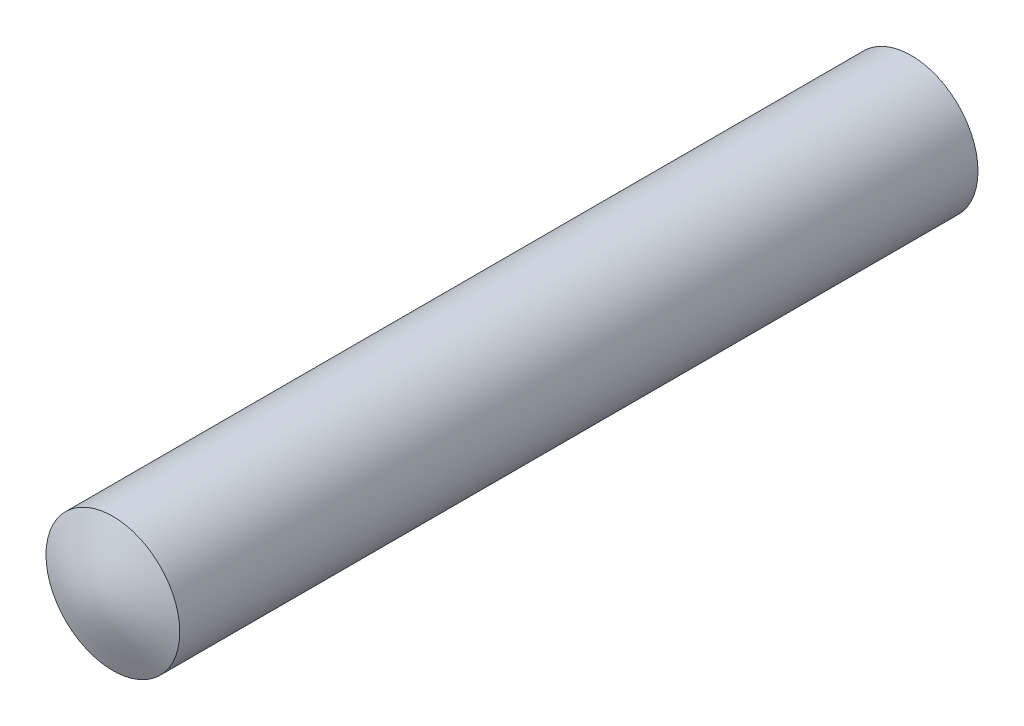
ISO-10303-21;
HEADER;
FILE_DESCRIPTION(('STEP AP214'),'2;1');
FILE_NAME('part.step','',(''),(''),'','','');
FILE_SCHEMA(('AUTOMOTIVE_DESIGN { 1 0 10303 214 1 1 1 1 }'));
ENDSEC;
DATA;
#1=APPLICATION_CONTEXT('core data for automotive mechanical design processes');
#2=APPLICATION_PROTOCOL_DEFINITION('international standard','automotive_design',2000,#1);
#3=PRODUCT_CONTEXT('',#1,'mechanical');
#4=PRODUCT('Part','Part','',(#3));
#5=PRODUCT_RELATED_PRODUCT_CATEGORY('part','',(#4));
#6=PRODUCT_DEFINITION_FORMATION('','',#4);
#7=PRODUCT_DEFINITION_CONTEXT('part definition',#1,'design');
#8=PRODUCT_DEFINITION('design','',#6,#7);
#9=PRODUCT_DEFINITION_SHAPE('','',#8);
#10=(LENGTH_UNIT() NAMED_UNIT(*) SI_UNIT(.MILLI.,.METRE.));
#11=(NAMED_UNIT(*) PLANE_ANGLE_UNIT() SI_UNIT($,.RADIAN.));
#12=(NAMED_UNIT(*) SI_UNIT($,.STERADIAN.) SOLID_ANGLE_UNIT());
#13=UNCERTAINTY_MEASURE_WITH_UNIT(LENGTH_MEASURE(1.E-05),#10,'distance_accuracy_value','');
#14=(GEOMETRIC_REPRESENTATION_CONTEXT(3) GLOBAL_UNCERTAINTY_ASSIGNED_CONTEXT((#13)) GLOBAL_UNIT_ASSIGNED_CONTEXT((#10,
#11,#12)) REPRESENTATION_CONTEXT('',''));
#15=CARTESIAN_POINT('',(0.,0.,0.));
#16=DIRECTION('',(0.,0.,1.));
#17=DIRECTION('',(1.,0.,0.));
#18=AXIS2_PLACEMENT_3D('',#15,#16,#17);
#19=CARTESIAN_POINT('',(-10.5244594907688,30.0492875827461,10.));
#20=DIRECTION('',(0.,0.,-1.));
#21=DIRECTION('',(-1.,0.,0.));
#22=AXIS2_PLACEMENT_3D('',#19,#20,#21);
#23=CYLINDRICAL_SURFACE('',#22,1.67526348251068);
#24=CARTESIAN_POINT('',(-12.1997229732795,30.0492875827195,10.0001212000588));
#25=CARTESIAN_POINT('',(-12.1997188004458,29.9551873017576,10.0001218226502));
#26=CARTESIAN_POINT('',(-12.191767888915,29.8610187900836,10.0001401553826));
#27=CARTESIAN_POINT('',(-12.1601604616911,29.6752752295067,10.0001326342529));
#28=CARTESIAN_POINT('',(-12.1364850439584,29.5837034403635,10.0001067271522));
#29=CARTESIAN_POINT('',(-12.0741025868434,29.4058711383558,10.0000947877364));
#30=CARTESIAN_POINT('',(-12.0354027259847,29.3196081117882,10.0001087363987));
#31=CARTESIAN_POINT('',(-11.944079792868,29.1548278056967,10.0001445191069));
#32=CARTESIAN_POINT('',(-11.8914601826877,29.0763086068087,10.0001663511924));
#33=CARTESIAN_POINT('',(-11.77378081401,28.9292089731597,10.0001901776857));
#34=CARTESIAN_POINT('',(-11.7087197574196,28.8606295767934,10.0001921700224));
#35=CARTESIAN_POINT('',(-11.5680050204534,28.735364465703,10.0001766108316));
#36=CARTESIAN_POINT('',(-11.492350924236,28.6786792181151,10.0001590585368));
#37=CARTESIAN_POINT('',(-11.3326012508319,28.5788156882472,10.0001188825536));
#38=CARTESIAN_POINT('',(-11.2485058319692,28.5356371526998,10.0000962589602));
#39=CARTESIAN_POINT('',(-11.0742597200714,28.4640114473262,10.0001010328882));
#40=CARTESIAN_POINT('',(-10.9841090392165,28.4355642478687,10.0001284303089));
#41=CARTESIAN_POINT('',(-10.8003112029227,28.3942085621746,10.0001515300006));
#42=CARTESIAN_POINT('',(-10.7066640416123,28.3813001020321,10.0001472322183));
#43=CARTESIAN_POINT('',(-10.5185319276214,28.3713884295552,10.0001501633563));
#44=CARTESIAN_POINT('',(-10.4240469764517,28.3743851885432,10.0001573922557));
#45=CARTESIAN_POINT('',(-10.2369211819921,28.3961988257896,10.0001471554434));
#46=CARTESIAN_POINT('',(-10.144280340202,28.4150157169134,10.0001296897116));
#47=CARTESIAN_POINT('',(-9.96347254225981,28.4679355095454,10.0001055447999));
#48=CARTESIAN_POINT('',(-9.87530559079551,28.5020384270703,10.0000988656314));
#49=CARTESIAN_POINT('',(-9.70594853027016,28.5845621700248,10.0001175652572));
#50=CARTESIAN_POINT('',(-9.62475841749602,28.6329829878343,10.0001429440345));
#51=CARTESIAN_POINT('',(-9.47165975492466,28.7427679942534,10.0001786221683));
#52=CARTESIAN_POINT('',(-9.39975120130801,28.8041321775366,10.000188921531));
#53=CARTESIAN_POINT('',(-9.26725685927908,28.9380620111202,10.0001894869471));
#54=CARTESIAN_POINT('',(-9.20667107612154,29.0106276666189,10.0001797529912));
#55=CARTESIAN_POINT('',(-9.0985421611291,29.1649005072214,10.0001440727961));
#56=CARTESIAN_POINT('',(-9.05099903114728,29.246607693624,10.0001181265546));
#57=CARTESIAN_POINT('',(-8.9703050433503,29.4168441607885,10.0000993219207));
#58=CARTESIAN_POINT('',(-8.93715418452558,29.5053734410719,10.0001064635261));
#59=CARTESIAN_POINT('',(-8.88618579269408,29.6867410080965,10.0001220854797));
#60=CARTESIAN_POINT('',(-8.86836825907057,29.7795792946643,10.0001305658279));
#61=CARTESIAN_POINT('',(-8.84857230434957,29.9669294501988,10.0001321657164));
#62=CARTESIAN_POINT('',(-8.84659387922247,30.0614413187396,10.0001252852607));
#63=CARTESIAN_POINT('',(-8.85853229304019,30.2494557532446,10.0001257653932));
#64=CARTESIAN_POINT('',(-8.87244913269446,30.3429583191637,10.000133125982));
#65=CARTESIAN_POINT('',(-8.91578302403389,30.5262999030066,10.000119683088));
#66=CARTESIAN_POINT('',(-8.94520007906884,30.6161389201386,10.000098879599));
#67=CARTESIAN_POINT('',(-9.01869933421713,30.789603108015,10.0001032051421));
#68=CARTESIAN_POINT('',(-9.06278153243773,30.8732282795613,10.0001283341681));
#69=CARTESIAN_POINT('',(-9.16435968642186,31.0318908796912,10.0001682334356));
#70=CARTESIAN_POINT('',(-9.22185563541522,31.1069283126091,10.0001830036824));
#71=CARTESIAN_POINT('',(-9.34862919196637,31.2462854241066,10.0001920870197));
#72=CARTESIAN_POINT('',(-9.41790680421834,31.310605098416,10.0001864001021));
#73=CARTESIAN_POINT('',(-9.5662771094558,31.4267008306954,10.0001572007357));
#74=CARTESIAN_POINT('',(-9.64536980625825,31.4784768837874,10.00013368828));
#75=CARTESIAN_POINT('',(-9.81112496901781,31.5680155279395,10.000102313192));
#76=CARTESIAN_POINT('',(-9.89778742695226,31.6057781338512,10.000094450543));
#77=CARTESIAN_POINT('',(-10.0762220581707,31.6662179803734,10.0001151752388));
#78=CARTESIAN_POINT('',(-10.1679942296457,31.6888952263242,10.0001437625706));
#79=CARTESIAN_POINT('',(-10.3540433564172,31.7185206634155,10.0001598597699));
#80=CARTESIAN_POINT('',(-10.4483203162354,31.725468826159,10.0001473695633));
#81=CARTESIAN_POINT('',(-10.6367024746835,31.7234387792986,10.0001469650314));
#82=CARTESIAN_POINT('',(-10.7308076735577,31.7144605923747,10.0001590506711));
#83=CARTESIAN_POINT('',(-10.9161752652491,31.680832705799,10.0001406657225));
#84=CARTESIAN_POINT('',(-11.0074376523568,31.6561829746748,10.0001101950486));
#85=CARTESIAN_POINT('',(-11.1845304037975,31.5919111630349,10.0000939715434));
#86=CARTESIAN_POINT('',(-11.2703606668677,31.5522888035032,10.0001082195454));
#87=CARTESIAN_POINT('',(-11.434147545277,31.4591981771421,10.0001438303799));
#88=CARTESIAN_POINT('',(-11.5121044695776,31.4057304539191,10.000165192933));
#89=CARTESIAN_POINT('',(-11.6579278600505,31.2864732716957,10.0001895076354));
#90=CARTESIAN_POINT('',(-11.7257953845919,31.2206851067371,10.0001924617169));
#91=CARTESIAN_POINT('',(-11.8495394591505,31.0786294423169,10.0001781537333));
#92=CARTESIAN_POINT('',(-11.90541302464,31.0023593422997,10.0001608866432));
#93=CARTESIAN_POINT('',(-12.0035834853697,30.8414915837329,10.0001212955815));
#94=CARTESIAN_POINT('',(-12.0458738870001,30.7568899673692,10.0000989691999));
#95=CARTESIAN_POINT('',(-12.1156023268519,30.581853918402,10.0001005617174));
#96=CARTESIAN_POINT('',(-12.1430581685005,30.491426623982,10.0001244250244));
#97=CARTESIAN_POINT('',(-12.1750206276888,30.3419004692473,10.0001369049033));
#98=CARTESIAN_POINT('',(-12.1842724462856,30.2837731906454,10.000135384842));
#99=CARTESIAN_POINT('',(-12.1966249229024,30.1668686838178,10.0001273378891));
#100=CARTESIAN_POINT('',(-12.1997255809101,30.1080914555907,10.0001208109974));
#101=CARTESIAN_POINT('',(-12.1997229732795,30.0492875827195,10.0001212000588));
#102=B_SPLINE_CURVE_WITH_KNOTS('',3,(#24,#25,#26,#27,#28,#29,#30,#31,#32,#33,#34,#35,#36,#37,
#38,#39,#40,#41,#42,#43,#44,#45,#46,#47,#48,#49,#50,#51,#52,#53,#54,#55,#56,#57,#58,#59,#60,#61,
#62,#63,#64,#65,#66,#67,#68,#69,#70,#71,#72,#73,#74,#75,#76,#77,#78,#79,#80,#81,#82,#83,#84,#85,
#86,#87,#88,#89,#90,#91,#92,#93,#94,#95,#96,#97,#98,#99,#100,#101),.UNSPECIFIED.,.T.,.F.,(4,2,2,
2,2,2,2,2,2,2,2,2,2,2,2,2,2,2,2,2,2,2,2,2,2,2,2,2,2,2,2,2,2,2,2,2,2,2,4),(0.,0.282086209401492,
0.564512122852525,0.84680326186306,1.12902425618637,1.41127471245048,1.69353625187594,
1.97579249823403,2.25804817684501,2.54030432944579,2.82255997313254,3.10481584636099,
3.38707201533823,3.6693280340973,3.95158393670529,4.23383997030371,4.51609604400467,
4.7983520979066,5.08060814045577,5.36286411119654,5.64512009453539,5.92737613887312,
6.20963214678174,6.49188801223104,6.77414399014004,7.0564000778155,7.33865586635133,
7.6209115549657,7.90316775316,8.18542354940686,8.46767991249609,8.74994153571331,
9.03219207825704,9.31441299204445,9.59670405132994,9.87912986338727,10.1612159700935,
10.3374934625081,10.5137709552721),.UNSPECIFIED.);
#103=CARTESIAN_POINT('',(-12.1997229732795,30.0492875827195,10.0001212000588));
#104=VERTEX_POINT('',#103);
#105=EDGE_CURVE('E12',#104,#104,#102,.T.);
#106=ORIENTED_EDGE('',*,*,#105,.F.);
#107=EDGE_LOOP('',(#106));
#108=FACE_BOUND('',#107,.T.);
#109=CARTESIAN_POINT('',(-12.1997229732795,30.0492875827726,-10.000121200058));
#110=CARTESIAN_POINT('',(-12.1997188004493,29.9551873016547,-10.0001218637651));
#111=CARTESIAN_POINT('',(-12.1917678888968,29.8610187898282,-10.0001402389215));
#112=CARTESIAN_POINT('',(-12.1601604615651,29.6752752289146,-10.0001328778122));
#113=CARTESIAN_POINT('',(-12.1364850437433,29.5837034395878,-10.0001070883983));
#114=CARTESIAN_POINT('',(-12.0741025864159,29.4058711372994,-10.0000952155726));
#115=CARTESIAN_POINT('',(-12.0354027254394,29.3196081106329,-10.0001091132189));
#116=CARTESIAN_POINT('',(-11.9440797920195,29.154827804337,-10.0001447015681));
#117=CARTESIAN_POINT('',(-11.8914601816519,29.0763086053446,-10.0001663903338));
#118=CARTESIAN_POINT('',(-11.7737808125046,28.9292089714473,-10.0001901637335));
#119=CARTESIAN_POINT('',(-11.7087197556093,28.8606295749552,-10.0001922463206));
#120=CARTESIAN_POINT('',(-11.568005017904,28.7353644636602,-10.0001771217884));
#121=CARTESIAN_POINT('',(-11.4923509212541,28.6786792159921,-10.0001599139116));
#122=CARTESIAN_POINT('',(-11.3326012466665,28.5788156859022,-10.000120188401));
#123=CARTESIAN_POINT('',(-11.248505827014,28.5356371502758,-10.0000976708669));
#124=CARTESIAN_POINT('',(-11.0742597134122,28.464011444976,-10.0001021374953));
#125=CARTESIAN_POINT('',(-10.9841090316435,28.4355642456705,-10.0001291215583));
#126=CARTESIAN_POINT('',(-10.8003111925325,28.3942085603311,-10.0001516801144));
#127=CARTESIAN_POINT('',(-10.7066640292773,28.3813001005756,-10.0001472545543));
#128=CARTESIAN_POINT('',(-10.5185319114659,28.3713884295107,-10.000150140876));
#129=CARTESIAN_POINT('',(-10.4240469584205,28.3743851895239,-10.0001574527364));
#130=CARTESIAN_POINT('',(-10.2369211617018,28.3961988292761,-10.0001469799956));
#131=CARTESIAN_POINT('',(-10.1442803195054,28.4150157216848,-10.0001291953743));
#132=CARTESIAN_POINT('',(-9.96347252098789,28.4679355170575,-10.0001044707173));
#133=CARTESIAN_POINT('',(-9.87530556935252,28.5020384360312,-10.0000975306931));
#134=CARTESIAN_POINT('',(-9.70594851038535,28.5845621812021,-10.0001162362578));
#135=CARTESIAN_POINT('',(-9.6247583992139,28.6329829995195,-10.0001418818288));
#136=CARTESIAN_POINT('',(-9.47165973976407,28.7427680065495,-10.0001781120937));
#137=CARTESIAN_POINT('',(-9.39975118766679,28.8041321899364,-10.0001886967939));
#138=CARTESIAN_POINT('',(-9.26725684790112,28.9380620240107,-10.0001895186815));
#139=CARTESIAN_POINT('',(-9.20667106559152,29.0106276799994,-10.0001797558593));
#140=CARTESIAN_POINT('',(-9.09854215234644,29.1649005213952,-10.0001439028532));
#141=CARTESIAN_POINT('',(-9.0509990232678,29.2466077081036,-10.0001178126669));
#142=CARTESIAN_POINT('',(-8.97030503739656,29.4168441754924,-10.0000988945171));
#143=CARTESIAN_POINT('',(-8.93715417955015,29.5053734556733,-10.0001060665511));
#144=CARTESIAN_POINT('',(-8.88618578957456,29.6867410223004,-10.0001218207481));
#145=CARTESIAN_POINT('',(-8.86836825682953,29.7795793085736,-10.0001304029109));
#146=CARTESIAN_POINT('',(-8.84857230371445,29.9669294635098,-10.0001321353041));
#147=CARTESIAN_POINT('',(-8.84659387933505,30.0614413317492,-10.0001252855384));
#148=CARTESIAN_POINT('',(-8.85853229453387,30.2494557655315,-10.0001258756305));
#149=CARTESIAN_POINT('',(-8.87244913482171,30.3429583310295,-10.0001333154889));
#150=CARTESIAN_POINT('',(-8.91578302738046,30.5262999143,-10.000120029017));
#151=CARTESIAN_POINT('',(-8.94520008305999,30.6161389312669,-10.0000993026806));
#152=CARTESIAN_POINT('',(-9.01869933947569,30.7896031187167,-10.0001035864516));
#153=CARTESIAN_POINT('',(-9.06278153831902,30.8732282900015,-10.0001285965532));
#154=CARTESIAN_POINT('',(-9.16435969381193,31.0318908899805,-10.0001682870041));
#155=CARTESIAN_POINT('',(-9.22185564377394,31.1069283229561,-10.0001829673586));
#156=CARTESIAN_POINT('',(-9.34862920231666,31.2462854343256,-10.0001921770224));
#157=CARTESIAN_POINT('',(-9.41790681559169,31.310605108449,-10.0001867063236));
#158=CARTESIAN_POINT('',(-9.56627712340978,31.4267008404805,-10.0001580498518));
#159=CARTESIAN_POINT('',(-9.64536982182808,31.4784768934361,-10.0001348640718));
#160=CARTESIAN_POINT('',(-9.81112498775241,31.5680155368216,-10.0001037008824));
#161=CARTESIAN_POINT('',(-9.89778744723749,31.6057781421001,-10.000095723457));
#162=CARTESIAN_POINT('',(-10.0762220820061,31.6662179870692,-10.0001159269649));
#163=CARTESIAN_POINT('',(-10.1679942555031,31.6888952320341,-10.0001441078856));
#164=CARTESIAN_POINT('',(-10.3540433860059,31.7185206665345,-10.0001598268383));
#165=CARTESIAN_POINT('',(-10.448320347533,31.725468827676,-10.000147364797));
#166=CARTESIAN_POINT('',(-10.6367025078712,31.7234387770866,-10.0001469726196));
#167=CARTESIAN_POINT('',(-10.7308077069289,31.7144605882498,-10.0001590424482));
#168=CARTESIAN_POINT('',(-10.9161752985038,31.6808326978372,-10.0001402134961));
#169=CARTESIAN_POINT('',(-11.0074376853122,31.6561829647933,-10.0001093146292));
#170=CARTESIAN_POINT('',(-11.1845304354584,31.5919111494654,-10.00009262654));
#171=CARTESIAN_POINT('',(-11.2703606975633,31.5522887882477,-10.0001068381581));
#172=CARTESIAN_POINT('',(-11.434147573696,31.4591981587991,-10.000142755114));
#173=CARTESIAN_POINT('',(-11.5121044966842,31.4057304341721,-10.0001644601574));
#174=CARTESIAN_POINT('',(-11.6579278835753,31.2864732500356,-10.0001892921916));
#175=CARTESIAN_POINT('',(-11.7257954059641,31.2206850847106,-10.0001924211325));
#176=CARTESIAN_POINT('',(-11.8495394763399,31.0786294200751,-10.0001781737187));
#177=CARTESIAN_POINT('',(-11.9054130397987,31.0023593202088,-10.0001607922672));
#178=CARTESIAN_POINT('',(-12.0035834968111,30.841491562233,-10.0001209879528));
#179=CARTESIAN_POINT('',(-12.0458738967309,30.756889946295,-10.0000985626874));
#180=CARTESIAN_POINT('',(-12.1156023334396,30.5818538985203,-10.000100153461));
#181=CARTESIAN_POINT('',(-12.1430581736563,30.4914266048671,-10.0001241136722));
#182=CARTESIAN_POINT('',(-12.175020630292,30.3419004539351,-10.0001367317734));
#183=CARTESIAN_POINT('',(-12.1842724479131,30.2837731783451,-10.0001352602468));
#184=CARTESIAN_POINT('',(-12.1966249232271,30.1668686776418,-10.0001272870117));
#185=CARTESIAN_POINT('',(-12.1997255809078,30.1080914525271,-10.0001207853032));
#186=CARTESIAN_POINT('',(-12.1997229732795,30.0492875827726,-10.000121200058));
#187=B_SPLINE_CURVE_WITH_KNOTS('',3,(#109,#110,#111,#112,#113,#114,#115,#116,#117,#118,#119,
#120,#121,#122,#123,#124,#125,#126,#127,#128,#129,#130,#131,#132,#133,#134,#135,#136,#137,#138,
#139,#140,#141,#142,#143,#144,#145,#146,#147,#148,#149,#150,#151,#152,#153,#154,#155,#156,#157,
#158,#159,#160,#161,#162,#163,#164,#165,#166,#167,#168,#169,#170,#171,#172,#173,#174,#175,#176,
#177,#178,#179,#180,#181,#182,#183,#184,#185,#186),.UNSPECIFIED.,.T.,.F.,(4,2,2,2,2,2,2,2,2,2,2,
2,2,2,2,2,2,2,2,2,2,2,2,2,2,2,2,2,2,2,2,2,2,2,2,2,2,2,4),(0.,0.282086209882213,
0.564512123869958,0.84680326331217,1.12902425810104,1.41127471534438,1.69353625571171,
1.9757925043218,2.25804818516926,2.54030434335405,2.82255999262916,3.10481586795353,
3.38707203889738,3.66932805450271,3.95158395397345,4.23383998702877,4.51609606026789,
4.79835211284043,5.08060815407648,5.36286412386503,5.6451201062546,5.92737615071467,
6.20963215874416,6.49188802605244,6.77414400582389,7.05640009703698,7.33865588917368,
7.6209115826254,7.90316778560157,8.18542358283458,8.46767994683186,8.74994156940178,
9.03219211134541,9.31441302126359,9.59670407669052,9.8791298853862,10.1612159887159,
10.3374934717959,10.5137709552252),.UNSPECIFIED.);
#188=CARTESIAN_POINT('',(-12.1997229732795,30.0492875827726,-10.000121200058));
#189=VERTEX_POINT('',#188);
#190=EDGE_CURVE('E103',#189,#189,#187,.T.);
#191=ORIENTED_EDGE('',*,*,#190,.T.);
#192=EDGE_LOOP('',(#191));
#193=FACE_BOUND('',#192,.T.);
#194=ADVANCED_FACE('F90',(#108,#193),#23,.T.);
#195=CARTESIAN_POINT('',(-8.74262162598679,28.3405346922468,9.6970934846097));
#196=CARTESIAN_POINT('',(-9.02771498558765,28.3405346922468,9.77009705089178));
#197=CARTESIAN_POINT('',(-9.31280834518851,28.3405346922468,9.83653175233707));
#198=CARTESIAN_POINT('',(-9.59790170478936,28.3405346922468,9.89853713559711));
#199=CARTESIAN_POINT('',(-10.0255423264311,28.3405346922468,9.96944876995989));
#200=CARTESIAN_POINT('',(-10.4531829480727,28.3405346922468,9.9890031087835));
#201=CARTESIAN_POINT('',(-10.5957302101136,28.3405346922468,9.98900335209079));
#202=CARTESIAN_POINT('',(-11.0233719962361,28.3405346922468,9.96944947728242));
#203=CARTESIAN_POINT('',(-11.4510137823586,28.3405346922468,9.89853410349302));
#204=CARTESIAN_POINT('',(-11.7361083064403,28.3405346922468,9.83653098674429));
#205=CARTESIAN_POINT('',(-12.0212028305219,28.3405346922468,9.77009750230016));
#206=CARTESIAN_POINT('',(-12.3062973546036,28.3405346922468,9.69709436956279));
#207=CARTESIAN_POINT('',(-8.74262162598679,28.6139344846945,9.76234343738507));
#208=CARTESIAN_POINT('',(-9.02771498558765,28.6139344846945,9.8468056092406));
#209=CARTESIAN_POINT('',(-9.31280834518851,28.6139344846945,9.92459615639325));
#210=CARTESIAN_POINT('',(-9.59790170478936,28.6139344846945,9.99844741925348));
#211=CARTESIAN_POINT('',(-10.0255423264311,28.6139344846945,10.0835473075462));
#212=CARTESIAN_POINT('',(-10.4531829480727,28.6139344846945,10.1070806122959));
#213=CARTESIAN_POINT('',(-10.5957302101136,28.6139344846945,10.1070807342937));
#214=CARTESIAN_POINT('',(-11.0233719962361,28.6139344846945,10.0835477282662));
#215=CARTESIAN_POINT('',(-11.4510137823586,28.6139344846945,9.99844549453267));
#216=CARTESIAN_POINT('',(-11.7361083064403,28.6139344846945,9.92459753402616));
#217=CARTESIAN_POINT('',(-12.0212028305219,28.6139344846945,9.84680686762945));
#218=CARTESIAN_POINT('',(-12.3062973546036,28.6139344846945,9.7623445339403));
#219=CARTESIAN_POINT('',(-8.74262162598679,28.8873342771421,9.82157681091753));
#220=CARTESIAN_POINT('',(-9.02771498558765,28.8873342771421,9.9173987288603));
#221=CARTESIAN_POINT('',(-9.31280834518851,28.8873342771421,10.0063654350632));
#222=CARTESIAN_POINT('',(-9.59790170478936,28.8873342771421,10.092450118552));
#223=CARTESIAN_POINT('',(-10.0255423264311,28.8873342771421,10.1921919256316));
#224=CARTESIAN_POINT('',(-10.4531829480727,28.8873342771421,10.2198372895801));
#225=CARTESIAN_POINT('',(-10.5957302101136,28.8873342771421,10.2198374335158));
#226=CARTESIAN_POINT('',(-11.0233719962361,28.8873342771421,10.1921913183247));
#227=CARTESIAN_POINT('',(-11.4510137823586,28.8873342771421,10.09245111467));
#228=CARTESIAN_POINT('',(-11.7361083064403,28.8873342771421,10.0063677424509));
#229=CARTESIAN_POINT('',(-12.0212028305219,28.8873342771421,9.9173999220295));
#230=CARTESIAN_POINT('',(-12.3062973546036,28.8873342771421,9.82157715320473));
#231=CARTESIAN_POINT('',(-8.74262162598679,29.1607340695898,9.87665364978348));
#232=CARTESIAN_POINT('',(-9.02771498558765,29.1607340695898,9.98437689436324));
#233=CARTESIAN_POINT('',(-9.31280834518851,29.1607340695898,10.0855582567888));
#234=CARTESIAN_POINT('',(-9.59790170478936,29.1607340695898,10.1849624063452));
#235=CARTESIAN_POINT('',(-10.0255423264311,29.1607340695898,10.2984085841837));
#236=CARTESIAN_POINT('',(-10.4531829480727,29.1607340695898,10.3302333892874));
#237=CARTESIAN_POINT('',(-10.5957302101136,29.1607340695898,10.3302334391171));
#238=CARTESIAN_POINT('',(-11.0233719962361,29.1607340695898,10.2984095904923));
#239=CARTESIAN_POINT('',(-11.4510137823586,29.1607340695898,10.1849639368531));
#240=CARTESIAN_POINT('',(-11.7361083064403,29.1607340695898,10.0855582443702));
#241=CARTESIAN_POINT('',(-12.0212028305219,29.1607340695898,9.98437645492193));
#242=CARTESIAN_POINT('',(-12.3062973546036,29.1607340695898,9.87665263941755));
#243=CARTESIAN_POINT('',(-8.74262162598679,29.5708343166215,9.93919827584993));
#244=CARTESIAN_POINT('',(-9.02771498558765,29.5708343166215,10.0612942239683));
#245=CARTESIAN_POINT('',(-9.31280834518851,29.5708343166215,10.177415669456));
#246=CARTESIAN_POINT('',(-9.59790170478936,29.5708343166215,10.2907394350537));
#247=CARTESIAN_POINT('',(-10.0255423264311,29.5708343166215,10.4303046807255));
#248=CARTESIAN_POINT('',(-10.4531829480727,29.5708343166215,10.4700893109662));
#249=CARTESIAN_POINT('',(-10.5957302101136,29.5708343166215,10.4700895607637));
#250=CARTESIAN_POINT('',(-11.0233719962361,29.5708343166215,10.4303060070488));
#251=CARTESIAN_POINT('',(-11.4510137823586,29.5708343166215,10.2907405736119));
#252=CARTESIAN_POINT('',(-11.7361083064403,29.5708343166215,10.1774162690349));
#253=CARTESIAN_POINT('',(-12.0212028305219,29.5708343166215,10.0612944811454));
#254=CARTESIAN_POINT('',(-12.3062973546036,29.5708343166215,9.93919803520545));
#255=CARTESIAN_POINT('',(-8.74262162598679,29.9809345636531,9.9563422781282));
#256=CARTESIAN_POINT('',(-9.02771498558765,29.9809345636531,10.0824890279806));
#257=CARTESIAN_POINT('',(-9.31280834518851,29.9809345636531,10.2028687972611));
#258=CARTESIAN_POINT('',(-9.59790170478936,29.9809345636531,10.3204733395245));
#259=CARTESIAN_POINT('',(-10.0255423264311,29.9809345636531,10.4680205426121));
#260=CARTESIAN_POINT('',(-10.4531829480727,29.9809345636531,10.5136787707403));
#261=CARTESIAN_POINT('',(-10.5957302101136,29.9809345636531,10.5136790273467));
#262=CARTESIAN_POINT('',(-11.0233719962361,29.9809345636531,10.4680220091446));
#263=CARTESIAN_POINT('',(-11.4510137823586,29.9809345636531,10.3204747743887));
#264=CARTESIAN_POINT('',(-11.7361083064403,29.9809345636531,10.2028697393608));
#265=CARTESIAN_POINT('',(-12.0212028305219,29.9809345636531,10.0824895196118));
#266=CARTESIAN_POINT('',(-12.3062973546036,29.9809345636531,9.95634227385434));
#267=CARTESIAN_POINT('',(-8.74262162598679,30.1176350182372,9.95634235808376));
#268=CARTESIAN_POINT('',(-9.02771498558765,30.1176350182372,10.0824891186302));
#269=CARTESIAN_POINT('',(-9.31280834518851,30.1176350182372,10.2028689018482));
#270=CARTESIAN_POINT('',(-9.59790170478936,30.1176350182372,10.3204734669345));
#271=CARTESIAN_POINT('',(-10.0255423264311,30.1176350182372,10.4680207433277));
#272=CARTESIAN_POINT('',(-10.4531829480727,30.1176350182372,10.5136790158071));
#273=CARTESIAN_POINT('',(-10.5957302101136,30.1176350182372,10.5136792979103));
#274=CARTESIAN_POINT('',(-11.0233719962361,30.1176350182372,10.4680222131524));
#275=CARTESIAN_POINT('',(-11.4510137823586,30.1176350182372,10.3204749767224));
#276=CARTESIAN_POINT('',(-11.7361083064403,30.1176350182372,10.2028699176758));
#277=CARTESIAN_POINT('',(-12.0212028305219,30.1176350182372,10.082489651584));
#278=CARTESIAN_POINT('',(-12.3062973546036,30.1176350182372,9.95634236567679));
#279=CARTESIAN_POINT('',(-8.74262162598679,30.5277363819893,9.93919861673398));
#280=CARTESIAN_POINT('',(-9.02771498558765,30.5277363819893,10.0612947102732));
#281=CARTESIAN_POINT('',(-9.31280834518851,30.5277363819893,10.177416197226));
#282=CARTESIAN_POINT('',(-9.59790170478936,30.5277363819893,10.2907401446241));
#283=CARTESIAN_POINT('',(-10.0255423264311,30.5277363819893,10.4303059339697));
#284=CARTESIAN_POINT('',(-10.4531829480727,30.5277363819893,10.4700907438567));
#285=CARTESIAN_POINT('',(-10.5957302101136,30.5277363819893,10.4700909201293));
#286=CARTESIAN_POINT('',(-11.0233719962361,30.5277363819893,10.4303073357723));
#287=CARTESIAN_POINT('',(-11.4510137823586,30.5277363819893,10.2907418591262));
#288=CARTESIAN_POINT('',(-11.7361083064403,30.5277363819893,10.1774174788679));
#289=CARTESIAN_POINT('',(-12.0212028305219,30.5277363819893,10.0612954465358));
#290=CARTESIAN_POINT('',(-12.3062973546036,30.5277363819893,9.93919886301397));
#291=CARTESIAN_POINT('',(-8.74262162598679,30.9378377457414,9.87665332850061));
#292=CARTESIAN_POINT('',(-9.02771498558765,30.9378377457414,9.98437685550377));
#293=CARTESIAN_POINT('',(-9.31280834518851,30.9378377457414,10.0855584104727));
#294=CARTESIAN_POINT('',(-9.59790170478936,30.9378377457414,10.1849638494331));
#295=CARTESIAN_POINT('',(-10.0255423264311,30.9378377457414,10.2984098610628));
#296=CARTESIAN_POINT('',(-10.4531829480727,30.9378377457414,10.3302346444059));
#297=CARTESIAN_POINT('',(-10.5957302101136,30.9378377457414,10.3302349510516));
#298=CARTESIAN_POINT('',(-11.0233719962361,30.9378377457414,10.298410992348));
#299=CARTESIAN_POINT('',(-11.4510137823586,30.9378377457414,10.1849648105662));
#300=CARTESIAN_POINT('',(-11.7361083064403,30.9378377457414,10.0855600672416));
#301=CARTESIAN_POINT('',(-12.0212028305219,30.9378377457414,9.98437817291058));
#302=CARTESIAN_POINT('',(-12.3062973546036,30.9378377457414,9.87665434862208));
#303=CARTESIAN_POINT('',(-8.74262162598679,31.2112386549095,9.82157761784847));
#304=CARTESIAN_POINT('',(-9.02771498558765,31.2112386549095,9.91740009682689));
#305=CARTESIAN_POINT('',(-9.31280834518851,31.2112386549095,10.0063676813383));
#306=CARTESIAN_POINT('',(-9.59790170478936,31.2112386549095,10.0924508061696));
#307=CARTESIAN_POINT('',(-10.0255423264311,31.2112386549095,10.1921912497848));
#308=CARTESIAN_POINT('',(-10.4531829480727,31.2112386549095,10.2198382005745));
#309=CARTESIAN_POINT('',(-10.5957302101136,31.2112386549095,10.2198383537596));
#310=CARTESIAN_POINT('',(-11.0233719962361,31.2112386549095,10.1921937508052));
#311=CARTESIAN_POINT('',(-11.4510137823586,31.2112386549095,10.0924519559461));
#312=CARTESIAN_POINT('',(-11.7361083064403,31.2112386549095,10.0063668138809));
#313=CARTESIAN_POINT('',(-12.0212028305219,31.2112386549095,9.91739967699384));
#314=CARTESIAN_POINT('',(-12.3062973546036,31.2112386549095,9.82157728021169));
#315=CARTESIAN_POINT('',(-8.74262162598679,31.4846395640776,9.76234478920902));
#316=CARTESIAN_POINT('',(-9.02771498558765,31.4846395640776,9.84680683538977));
#317=CARTESIAN_POINT('',(-9.31280834518851,31.4846395640776,9.92459726729646));
#318=CARTESIAN_POINT('',(-9.59790170478936,31.4846395640776,9.99844497918395));
#319=CARTESIAN_POINT('',(-10.0255423264311,31.4846395640776,10.0835473880043));
#320=CARTESIAN_POINT('',(-10.4531829480727,31.4846395640776,10.1070810829185));
#321=CARTESIAN_POINT('',(-10.5957302101136,31.4846395640776,10.107081219891));
#322=CARTESIAN_POINT('',(-11.0233719962361,31.4846395640776,10.0835485743691));
#323=CARTESIAN_POINT('',(-11.4510137823586,31.4846395640776,9.99844874888236));
#324=CARTESIAN_POINT('',(-11.7361083064403,31.4846395640776,9.92459713247394));
#325=CARTESIAN_POINT('',(-12.0212028305219,31.4846395640776,9.84680624861022));
#326=CARTESIAN_POINT('',(-12.3062973546036,31.4846395640776,9.76234368653877));
#327=CARTESIAN_POINT('',(-8.74262162598679,31.7580404732457,9.69709437076536));
#328=CARTESIAN_POINT('',(-9.02771498558765,31.7580404732457,9.77009721626953));
#329=CARTESIAN_POINT('',(-9.31280834518851,31.7580404732457,9.83653046322476));
#330=CARTESIAN_POINT('',(-9.59790170478936,31.7580404732457,9.89853333632789));
#331=CARTESIAN_POINT('',(-10.0255423264311,31.7580404732457,9.96944880780389));
#332=CARTESIAN_POINT('',(-10.4531829480727,31.7580404732457,9.98900324474657));
#333=CARTESIAN_POINT('',(-10.5957302101136,31.7580404732457,9.98900321659354));
#334=CARTESIAN_POINT('',(-11.0233719962361,31.7580404732457,9.96944944293254));
#335=CARTESIAN_POINT('',(-11.4510137823586,31.7580404732457,9.89853791400243));
#336=CARTESIAN_POINT('',(-11.7361083064403,31.7580404732457,9.83653228232433));
#337=CARTESIAN_POINT('',(-12.0212028305219,31.7580404732457,9.77009733229864));
#338=CARTESIAN_POINT('',(-12.3062973546036,31.7580404732457,9.69709346828637));
#339=B_SPLINE_SURFACE_WITH_KNOTS('',5,5,((#195,#196,#197,#198,#199,#200,#201,#202,#203,#204,
#205,#206),(#207,#208,#209,#210,#211,#212,#213,#214,#215,#216,#217,#218),(#219,#220,#221,#222,
#223,#224,#225,#226,#227,#228,#229,#230),(#231,#232,#233,#234,#235,#236,#237,#238,#239,#240,
#241,#242),(#243,#244,#245,#246,#247,#248,#249,#250,#251,#252,#253,#254),(#255,#256,#257,#258,
#259,#260,#261,#262,#263,#264,#265,#266),(#267,#268,#269,#270,#271,#272,#273,#274,#275,#276,
#277,#278),(#279,#280,#281,#282,#283,#284,#285,#286,#287,#288,#289,#290),(#291,#292,#293,#294,
#295,#296,#297,#298,#299,#300,#301,#302),(#303,#304,#305,#306,#307,#308,#309,#310,#311,#312,
#313,#314),(#315,#316,#317,#318,#319,#320,#321,#322,#323,#324,#325,#326),(#327,#328,#329,#330,
#331,#332,#333,#334,#335,#336,#337,#338)),.UNSPECIFIED.,.F.,.F.,.F.,(6,3,3,6),(6,3,3,6),
(-1.7087528905565,-0.341753928318282,0.341748344601915,1.70875289044231),(-1.78183786477593,
-0.356371066771642,0.356365243432524,1.78183786384086),.UNSPECIFIED.);
#340=ORIENTED_EDGE('',*,*,#105,.T.);
#341=EDGE_LOOP('',(#340));
#342=FACE_BOUND('',#341,.T.);
#343=ADVANCED_FACE('F92',(#342),#339,.T.);
#344=CARTESIAN_POINT('',(-8.74262162593372,28.3405346922468,-9.69709437718641));
#345=CARTESIAN_POINT('',(-9.02771498553883,28.3405346922468,-9.77009721750937));
#346=CARTESIAN_POINT('',(-9.31280834514394,28.3405346922468,-9.83653045963768));
#347=CARTESIAN_POINT('',(-9.59790170474904,28.3405346922468,-9.89853333119337));
#348=CARTESIAN_POINT('',(-10.0255423263971,28.3405346922468,-9.9694488061755));
#349=CARTESIAN_POINT('',(-10.4531829480452,28.3405346922468,-9.98900324448594));
#350=CARTESIAN_POINT('',(-10.5957302100881,28.3405346922468,-9.98900321633697));
#351=CARTESIAN_POINT('',(-11.023371996217,28.3405346922468,-9.9694494413463));
#352=CARTESIAN_POINT('',(-11.4510137823459,28.3405346922468,-9.8985379089218));
#353=CARTESIAN_POINT('',(-11.7361083064318,28.3405346922468,-9.83653227873809));
#354=CARTESIAN_POINT('',(-12.0212028305177,28.3405346922468,-9.7700973335293));
#355=CARTESIAN_POINT('',(-12.3062973546037,28.3405346922468,-9.69709347468506));
#356=CARTESIAN_POINT('',(-8.74262162593372,28.6139344846964,-9.7623445358558));
#357=CARTESIAN_POINT('',(-9.02771498553883,28.6139344846964,-9.84680653032086));
#358=CARTESIAN_POINT('',(-9.31280834514394,28.6139344846964,-9.92459691172627));
#359=CARTESIAN_POINT('',(-9.59790170474904,28.6139344846964,-9.99844457216305));
#360=CARTESIAN_POINT('',(-10.0255423263971,28.6139344846964,-10.0835469248467));
#361=CARTESIAN_POINT('',(-10.4531829480452,28.6139344846964,-10.1070806047261));
#362=CARTESIAN_POINT('',(-10.5957302100881,28.6139344846964,-10.107080741702));
#363=CARTESIAN_POINT('',(-11.023371996217,28.6139344846964,-10.0835481112432));
#364=CARTESIAN_POINT('',(-11.4510137823459,28.6139344846964,-9.99844834189284));
#365=CARTESIAN_POINT('',(-11.7361083064318,28.6139344846964,-9.92459677690943));
#366=CARTESIAN_POINT('',(-12.0212028305177,28.6139344846964,-9.84680594353801));
#367=CARTESIAN_POINT('',(-12.3062973546037,28.6139344846964,-9.76234343317201));
#368=CARTESIAN_POINT('',(-8.74262162593372,28.887334277146,-9.82157714921068));
#369=CARTESIAN_POINT('',(-9.02771498553883,28.887334277146,-9.91739953383169));
#370=CARTESIAN_POINT('',(-9.31280834514394,28.887334277146,-10.0063670204286));
#371=CARTESIAN_POINT('',(-9.59790170474904,28.887334277146,-10.0924500428984));
#372=CARTESIAN_POINT('',(-10.0255423263971,28.887334277146,-10.1921903711063));
#373=CARTESIAN_POINT('',(-10.4531829480452,28.887334277146,-10.2198372850607));
#374=CARTESIAN_POINT('',(-10.5957302100881,28.887334277146,-10.2198374382496));
#375=CARTESIAN_POINT('',(-11.023371996217,28.887334277146,-10.1921928721417));
#376=CARTESIAN_POINT('',(-11.4510137823459,28.887334277146,-10.0924511927088));
#377=CARTESIAN_POINT('',(-11.7361083064318,28.887334277146,-10.0063661529814));
#378=CARTESIAN_POINT('',(-12.0212028305177,28.887334277146,-9.91739911399957));
#379=CARTESIAN_POINT('',(-12.3062973546037,28.887334277146,-9.82157681156714));
#380=CARTESIAN_POINT('',(-8.74262162593372,29.1607340695956,-9.87665264295562));
#381=CARTESIAN_POINT('',(-9.02771498553883,29.1607340695956,-9.98437601960436));
#382=CARTESIAN_POINT('',(-9.31280834514394,29.1607340695956,-10.0855574242629));
#383=CARTESIAN_POINT('',(-9.59790170474904,29.1607340695956,-10.1849626897958));
#384=CARTESIAN_POINT('',(-10.0255423263971,29.1607340695956,-10.2984085223925));
#385=CARTESIAN_POINT('',(-10.4531829480452,29.1607340695956,-10.3302332607602));
#386=CARTESIAN_POINT('',(-10.5957302100881,29.1607340695956,-10.3302335674079));
#387=CARTESIAN_POINT('',(-11.023371996217,29.1607340695956,-10.2984096537015));
#388=CARTESIAN_POINT('',(-11.4510137823459,29.1607340695956,-10.1849636509467));
#389=CARTESIAN_POINT('',(-11.7361083064318,29.1607340695956,-10.085559081046));
#390=CARTESIAN_POINT('',(-12.0212028305177,29.1607340695956,-9.98437733702714));
#391=CARTESIAN_POINT('',(-12.3062973546037,29.1607340695956,-9.87665366308757));
#392=CARTESIAN_POINT('',(-8.74262162593372,29.5708343166278,-9.93919802626585));
#393=CARTESIAN_POINT('',(-9.02771498553883,29.5708343166278,-10.061293984607));
#394=CARTESIAN_POINT('',(-9.31280834514394,29.5708343166278,-10.1774153245758));
#395=CARTESIAN_POINT('',(-9.59790170474904,29.5708343166278,-10.2907391482106));
#396=CARTESIAN_POINT('',(-10.0255423263971,29.5708343166278,-10.43030464202));
#397=CARTESIAN_POINT('',(-10.4531829480452,29.5708343166278,-10.4700893479272));
#398=CARTESIAN_POINT('',(-10.5957302100881,29.5708343166278,-10.4700895242031));
#399=CARTESIAN_POINT('',(-11.023371996217,29.5708343166278,-10.430306043837));
#400=CARTESIAN_POINT('',(-11.4510137823459,29.5708343166278,-10.290740862739));
#401=CARTESIAN_POINT('',(-11.7361083064318,29.5708343166278,-10.1774166062498));
#402=CARTESIAN_POINT('',(-12.0212028305177,29.5708343166278,-10.0612947208952));
#403=CARTESIAN_POINT('',(-12.3062973546037,29.5708343166278,-9.93919827256633));
#404=CARTESIAN_POINT('',(-8.74262162593372,29.9809345636599,-9.95634226385774));
#405=CARTESIAN_POINT('',(-9.02771498553883,29.9809345636599,-10.082489001943));
#406=CARTESIAN_POINT('',(-9.31280834514394,29.9809345636599,-10.2028687650244));
#407=CARTESIAN_POINT('',(-9.59790170474904,29.9809345636599,-10.320473300225));
#408=CARTESIAN_POINT('',(-10.0255423263971,29.9809345636599,-10.4680205416504));
#409=CARTESIAN_POINT('',(-10.4531829480452,29.9809345636599,-10.5136787578514));
#410=CARTESIAN_POINT('',(-10.5957302100881,29.9809345636599,-10.5136790399571));
#411=CARTESIAN_POINT('',(-11.023371996217,29.9809345636599,-10.4680220114952));
#412=CARTESIAN_POINT('',(-11.4510137823459,29.9809345636599,-10.3204748100438));
#413=CARTESIAN_POINT('',(-11.7361083064318,29.9809345636599,-10.2028697808829));
#414=CARTESIAN_POINT('',(-12.0212028305177,29.9809345636599,-10.0824895349248));
#415=CARTESIAN_POINT('',(-12.3062973546037,29.9809345636599,-9.95634227147308));
#416=CARTESIAN_POINT('',(-8.74262162593372,30.1176350182424,-9.95634237230795));
#417=CARTESIAN_POINT('',(-9.02771498553883,30.1176350182424,-10.0824891446204));
#418=CARTESIAN_POINT('',(-9.31280834514394,30.1176350182424,-10.2028689340396));
#419=CARTESIAN_POINT('',(-9.59790170474904,30.1176350182424,-10.3204735061939));
#420=CARTESIAN_POINT('',(-10.0255423263971,30.1176350182424,-10.468020744267));
#421=CARTESIAN_POINT('',(-10.4531829480452,30.1176350182424,-10.5136790286928));
#422=CARTESIAN_POINT('',(-10.5957302100881,30.1176350182424,-10.5136792853033));
#423=CARTESIAN_POINT('',(-11.023371996217,30.1176350182424,-10.4680222108204));
#424=CARTESIAN_POINT('',(-11.4510137823459,30.1176350182424,-10.3204749410897));
#425=CARTESIAN_POINT('',(-11.7361083064318,30.1176350182424,-10.2028698761706));
#426=CARTESIAN_POINT('',(-12.0212028305177,30.1176350182424,-10.0824896362797));
#427=CARTESIAN_POINT('',(-12.3062973546037,30.1176350182424,-9.95634236805636));
#428=CARTESIAN_POINT('',(-8.74262162593372,30.52773638199,-9.93919886627571));
#429=CARTESIAN_POINT('',(-9.02771498553883,30.52773638199,-10.0612949495908));
#430=CARTESIAN_POINT('',(-9.31280834514394,30.52773638199,-10.1774165420593));
#431=CARTESIAN_POINT('',(-9.59790170474904,30.52773638199,-10.2907404314317));
#432=CARTESIAN_POINT('',(-10.0255423263971,30.52773638199,-10.4303059726557));
#433=CARTESIAN_POINT('',(-10.4531829480452,30.52773638199,-10.4700907068928));
#434=CARTESIAN_POINT('',(-10.5957302100881,30.52773638199,-10.4700909566942));
#435=CARTESIAN_POINT('',(-11.023371996217,30.52773638199,-10.430307299001));
#436=CARTESIAN_POINT('',(-11.4510137823459,30.52773638199,-10.2907415700189));
#437=CARTESIAN_POINT('',(-11.7361083064318,30.52773638199,-10.177417141673));
#438=CARTESIAN_POINT('',(-12.0212028305177,30.52773638199,-10.0612952067946));
#439=CARTESIAN_POINT('',(-12.3062973546037,30.52773638199,-9.93919862565167));
#440=CARTESIAN_POINT('',(-8.74262162593372,30.9378377457376,-9.87665433529912));
#441=CARTESIAN_POINT('',(-9.02771498553883,30.9378377457376,-9.98437773023121));
#442=CARTESIAN_POINT('',(-9.31280834514394,30.9378377457376,-10.0855592429731));
#443=CARTESIAN_POINT('',(-9.59790170474904,30.9378377457376,-10.1849635659567));
#444=CARTESIAN_POINT('',(-10.0255423263971,30.9378377457376,-10.2984099228287));
#445=CARTESIAN_POINT('',(-10.4531829480452,30.9378377457376,-10.3302347729322));
#446=CARTESIAN_POINT('',(-10.5957302100881,30.9378377457376,-10.3302348227648));
#447=CARTESIAN_POINT('',(-11.023371996217,30.9378377457376,-10.2984109291638));
#448=CARTESIAN_POINT('',(-11.4510137823459,30.9378377457376,-10.1849650964873));
#449=CARTESIAN_POINT('',(-11.7361083064318,30.9378377457376,-10.0855592305708));
#450=CARTESIAN_POINT('',(-12.0212028305177,30.9378377457376,-9.98437729080723));
#451=CARTESIAN_POINT('',(-12.3062973546037,30.9378377457376,-9.87665332494378));
#452=CARTESIAN_POINT('',(-8.74262162593372,31.2112386549027,-9.82157727954669));
#453=CARTESIAN_POINT('',(-9.02771498553883,31.2112386549027,-9.91739929184257));
#454=CARTESIAN_POINT('',(-9.31280834514394,31.2112386549027,-10.0063660959537));
#455=CARTESIAN_POINT('',(-9.59790170474904,31.2112386549027,-10.0924508817842));
#456=CARTESIAN_POINT('',(-10.0255423263971,31.2112386549027,-10.1921928042947));
#457=CARTESIAN_POINT('',(-10.4531829480452,31.2112386549027,-10.2198382050921));
#458=CARTESIAN_POINT('',(-10.5957302100881,31.2112386549027,-10.2198383490319));
#459=CARTESIAN_POINT('',(-11.023371996217,31.2112386549027,-10.1921921970053));
#460=CARTESIAN_POINT('',(-11.4510137823459,31.2112386549027,-10.0924518779382));
#461=CARTESIAN_POINT('',(-11.7361083064318,31.2112386549027,-10.0063684033537));
#462=CARTESIAN_POINT('',(-12.0212028305177,31.2112386549027,-9.91740048501352));
#463=CARTESIAN_POINT('',(-12.3062973546037,31.2112386549027,-9.82157762182722));
#464=CARTESIAN_POINT('',(-8.74262162593372,31.4846395640678,-9.76234369074014));
#465=CARTESIAN_POINT('',(-9.02771498553883,31.4846395640678,-9.84680591430416));
#466=CARTESIAN_POINT('',(-9.31280834514394,31.4846395640678,-9.92459651195227));
#467=CARTESIAN_POINT('',(-9.59790170474904,31.4846395640678,-9.99844782624069));
#468=CARTESIAN_POINT('',(-10.0255423263971,31.4846395640678,-10.083547770674));
#469=CARTESIAN_POINT('',(-10.4531829480452,31.4846395640678,-10.1070810904885));
#470=CARTESIAN_POINT('',(-10.5957302100881,31.4846395640678,-10.1070812124899));
#471=CARTESIAN_POINT('',(-11.023371996217,31.4846395640678,-10.0835481914267));
#472=CARTESIAN_POINT('',(-11.4510137823459,31.4846395640678,-9.99844590155261));
#473=CARTESIAN_POINT('',(-11.7361083064318,31.4846395640678,-9.92459788959172));
#474=CARTESIAN_POINT('',(-12.0212028305177,31.4846395640678,-9.84680717269026));
#475=CARTESIAN_POINT('',(-12.3062973546037,31.4846395640678,-9.76234478728194));
#476=CARTESIAN_POINT('',(-8.74262162593372,31.7580404732329,-9.69709347820361));
#477=CARTESIAN_POINT('',(-9.02771498553883,31.7580404732329,-9.77009704965653));
#478=CARTESIAN_POINT('',(-9.31280834514394,31.7580404732329,-9.83653175592158));
#479=CARTESIAN_POINT('',(-9.59790170474904,31.7580404732329,-9.89853714067907));
#480=CARTESIAN_POINT('',(-10.0255423263971,31.7580404732329,-9.96944877155097));
#481=CARTESIAN_POINT('',(-10.4531829480452,31.7580404732329,-9.98900310904587));
#482=CARTESIAN_POINT('',(-10.5957302100881,31.7580404732329,-9.98900335235719));
#483=CARTESIAN_POINT('',(-11.023371996217,31.7580404732329,-9.96944947891547));
#484=CARTESIAN_POINT('',(-11.4510137823459,31.7580404732329,-9.89853410862883));
#485=CARTESIAN_POINT('',(-11.7361083064318,31.7580404732329,-9.8365309903298));
#486=CARTESIAN_POINT('',(-12.0212028305177,31.7580404732329,-9.77009750105585));
#487=CARTESIAN_POINT('',(-12.3062973546037,31.7580404732329,-9.6970943631344));
#488=B_SPLINE_SURFACE_WITH_KNOTS('',5,5,((#344,#345,#346,#347,#348,#349,#350,#351,#352,#353,
#354,#355),(#356,#357,#358,#359,#360,#361,#362,#363,#364,#365,#366,#367),(#368,#369,#370,#371,
#372,#373,#374,#375,#376,#377,#378,#379),(#380,#381,#382,#383,#384,#385,#386,#387,#388,#389,
#390,#391),(#392,#393,#394,#395,#396,#397,#398,#399,#400,#401,#402,#403),(#404,#405,#406,#407,
#408,#409,#410,#411,#412,#413,#414,#415),(#416,#417,#418,#419,#420,#421,#422,#423,#424,#425,
#426,#427),(#428,#429,#430,#431,#432,#433,#434,#435,#436,#437,#438,#439),(#440,#441,#442,#443,
#444,#445,#446,#447,#448,#449,#450,#451),(#452,#453,#454,#455,#456,#457,#458,#459,#460,#461,
#462,#463),(#464,#465,#466,#467,#468,#469,#470,#471,#472,#473,#474,#475),(#476,#477,#478,#479,
#480,#481,#482,#483,#484,#485,#486,#487)),.UNSPECIFIED.,.F.,.F.,.F.,(6,3,3,6),(6,3,3,6),
(-1.70875289044211,-0.341753928194071,0.341748344718607,1.70875289054396),(-1.78183786482899,
-0.356371066803445,0.35636524341135,1.78183786384094),.UNSPECIFIED.);
#489=ORIENTED_EDGE('',*,*,#190,.F.);
#490=EDGE_LOOP('',(#489));
#491=FACE_BOUND('',#490,.T.);
#492=ADVANCED_FACE('F112',(#491),#488,.F.);
#493=CLOSED_SHELL('',(#194,#343,#492));
#494=MANIFOLD_SOLID_BREP('B2',#493);
#495=ADVANCED_BREP_SHAPE_REPRESENTATION('',(#18,#494),#14);
#496=SHAPE_DEFINITION_REPRESENTATION(#9,#495);
ENDSEC;
END-ISO-10303-21;
